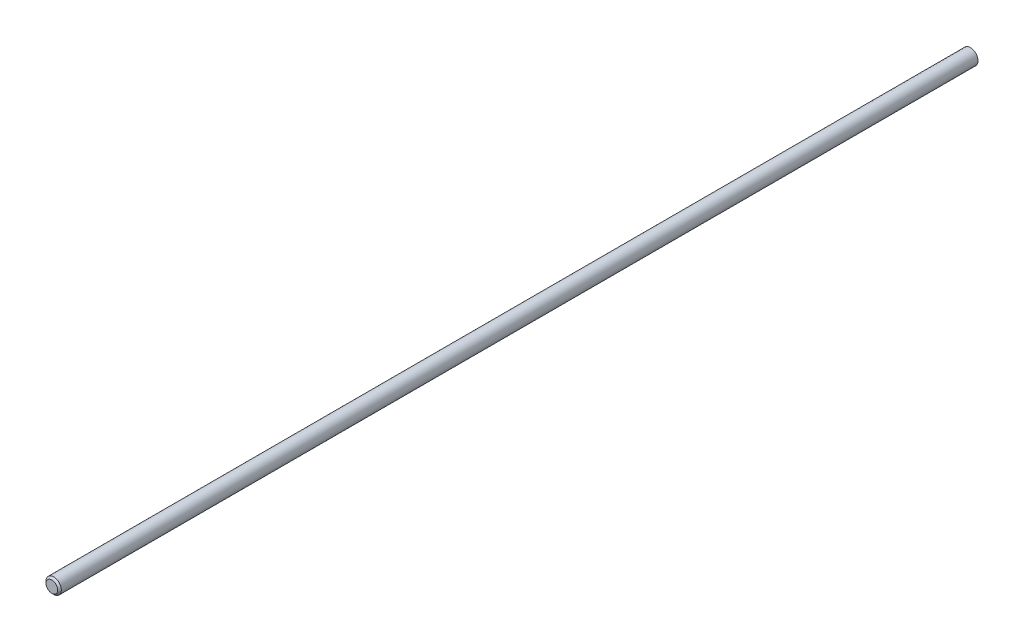
ISO-10303-21;
HEADER;
FILE_DESCRIPTION(('STEP AP214'),'2;1');
FILE_NAME('part.step','',(''),(''),'','','');
FILE_SCHEMA(('AUTOMOTIVE_DESIGN { 1 0 10303 214 1 1 1 1 }'));
ENDSEC;
DATA;
#1=APPLICATION_CONTEXT('core data for automotive mechanical design processes');
#2=APPLICATION_PROTOCOL_DEFINITION('international standard','automotive_design',2000,#1);
#3=PRODUCT_CONTEXT('',#1,'mechanical');
#4=PRODUCT('Part','Part','',(#3));
#5=PRODUCT_RELATED_PRODUCT_CATEGORY('part','',(#4));
#6=PRODUCT_DEFINITION_FORMATION('','',#4);
#7=PRODUCT_DEFINITION_CONTEXT('part definition',#1,'design');
#8=PRODUCT_DEFINITION('design','',#6,#7);
#9=PRODUCT_DEFINITION_SHAPE('','',#8);
#10=(LENGTH_UNIT() NAMED_UNIT(*) SI_UNIT(.MILLI.,.METRE.));
#11=(NAMED_UNIT(*) PLANE_ANGLE_UNIT() SI_UNIT($,.RADIAN.));
#12=(NAMED_UNIT(*) SI_UNIT($,.STERADIAN.) SOLID_ANGLE_UNIT());
#13=UNCERTAINTY_MEASURE_WITH_UNIT(LENGTH_MEASURE(1.E-05),#10,'distance_accuracy_value','');
#14=(GEOMETRIC_REPRESENTATION_CONTEXT(3) GLOBAL_UNCERTAINTY_ASSIGNED_CONTEXT((#13)) GLOBAL_UNIT_ASSIGNED_CONTEXT((#10,
#11,#12)) REPRESENTATION_CONTEXT('',''));
#15=CARTESIAN_POINT('',(0.,0.,0.));
#16=DIRECTION('',(0.,0.,1.));
#17=DIRECTION('',(1.,0.,0.));
#18=AXIS2_PLACEMENT_3D('',#15,#16,#17);
#19=CARTESIAN_POINT('',(0.,0.,0.));
#20=DIRECTION('',(0.,0.,1.));
#21=DIRECTION('',(1.,0.,0.));
#22=AXIS2_PLACEMENT_3D('',#19,#20,#21);
#23=PLANE('',#22);
#24=CARTESIAN_POINT('',(0.,0.,0.));
#25=DIRECTION('',(0.,0.,-1.));
#26=DIRECTION('',(-1.,0.,0.));
#27=AXIS2_PLACEMENT_3D('',#24,#25,#26);
#28=CIRCLE('',#27,3.175);
#29=CARTESIAN_POINT('',(-3.175,0.,0.));
#30=VERTEX_POINT('',#29);
#31=EDGE_CURVE('E10',#30,#30,#28,.T.);
#32=ORIENTED_EDGE('',*,*,#31,.T.);
#33=EDGE_LOOP('',(#32));
#34=FACE_BOUND('',#33,.T.);
#35=ADVANCED_FACE('F39',(#34),#23,.F.);
#36=CARTESIAN_POINT('',(0.,0.,381.));
#37=DIRECTION('',(0.,0.,-1.));
#38=DIRECTION('',(-1.,0.,0.));
#39=AXIS2_PLACEMENT_3D('',#36,#37,#38);
#40=CYLINDRICAL_SURFACE('',#39,3.175);
#41=ORIENTED_EDGE('',*,*,#31,.F.);
#42=EDGE_LOOP('',(#41));
#43=FACE_BOUND('',#42,.T.);
#44=CARTESIAN_POINT('',(0.,0.,380.24435));
#45=DIRECTION('',(0.,0.,-1.));
#46=DIRECTION('',(-1.,0.,0.));
#47=AXIS2_PLACEMENT_3D('',#44,#45,#46);
#48=CIRCLE('',#47,3.175);
#49=CARTESIAN_POINT('',(-3.175,0.,380.24435));
#50=VERTEX_POINT('',#49);
#51=EDGE_CURVE('E49',#50,#50,#48,.T.);
#52=ORIENTED_EDGE('',*,*,#51,.T.);
#53=EDGE_LOOP('',(#52));
#54=FACE_BOUND('',#53,.T.);
#55=ADVANCED_FACE('F56',(#43,#54),#40,.T.);
#56=CARTESIAN_POINT('',(0.,0.,381.));
#57=DIRECTION('',(0.,0.,-1.));
#58=DIRECTION('',(-1.,0.,0.));
#59=AXIS2_PLACEMENT_3D('',#56,#57,#58);
#60=CONICAL_SURFACE('',#59,2.41935,0.78539816339745);
#61=ORIENTED_EDGE('',*,*,#51,.F.);
#62=EDGE_LOOP('',(#61));
#63=FACE_BOUND('',#62,.T.);
#64=CARTESIAN_POINT('',(0.,0.,381.));
#65=DIRECTION('',(0.,0.,-1.));
#66=DIRECTION('',(-1.,0.,0.));
#67=AXIS2_PLACEMENT_3D('',#64,#65,#66);
#68=CIRCLE('',#67,2.41935);
#69=CARTESIAN_POINT('',(-2.41935,0.,381.));
#70=VERTEX_POINT('',#69);
#71=EDGE_CURVE('E45',#70,#70,#68,.T.);
#72=ORIENTED_EDGE('',*,*,#71,.T.);
#73=EDGE_LOOP('',(#72));
#74=FACE_BOUND('',#73,.T.);
#75=ADVANCED_FACE('F58',(#63,#74),#60,.T.);
#76=CARTESIAN_POINT('',(0.,0.,381.));
#77=DIRECTION('',(0.,0.,1.));
#78=DIRECTION('',(1.,0.,0.));
#79=AXIS2_PLACEMENT_3D('',#76,#77,#78);
#80=PLANE('',#79);
#81=ORIENTED_EDGE('',*,*,#71,.F.);
#82=EDGE_LOOP('',(#81));
#83=FACE_BOUND('',#82,.T.);
#84=ADVANCED_FACE('F60',(#83),#80,.T.);
#85=CLOSED_SHELL('',(#35,#55,#75,#84));
#86=MANIFOLD_SOLID_BREP('B2',#85);
#87=ADVANCED_BREP_SHAPE_REPRESENTATION('',(#18,#86),#14);
#88=SHAPE_DEFINITION_REPRESENTATION(#9,#87);
ENDSEC;
END-ISO-10303-21;
